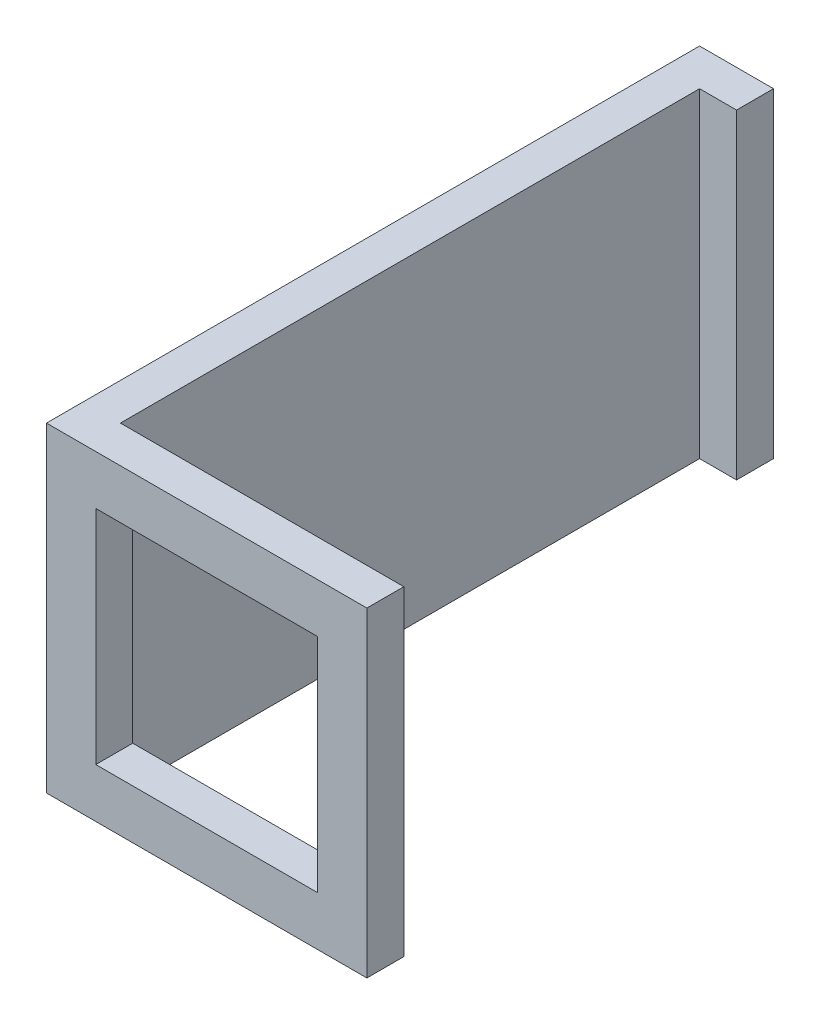
ISO-10303-21;
HEADER;
FILE_DESCRIPTION(('STEP AP214'),'2;1');
FILE_NAME('part.step','',(''),(''),'','','');
FILE_SCHEMA(('AUTOMOTIVE_DESIGN { 1 0 10303 214 1 1 1 1 }'));
ENDSEC;
DATA;
#1=APPLICATION_CONTEXT('core data for automotive mechanical design processes');
#2=APPLICATION_PROTOCOL_DEFINITION('international standard','automotive_design',2000,#1);
#3=PRODUCT_CONTEXT('',#1,'mechanical');
#4=PRODUCT('Part','Part','',(#3));
#5=PRODUCT_RELATED_PRODUCT_CATEGORY('part','',(#4));
#6=PRODUCT_DEFINITION_FORMATION('','',#4);
#7=PRODUCT_DEFINITION_CONTEXT('part definition',#1,'design');
#8=PRODUCT_DEFINITION('design','',#6,#7);
#9=PRODUCT_DEFINITION_SHAPE('','',#8);
#10=(LENGTH_UNIT() NAMED_UNIT(*) SI_UNIT(.MILLI.,.METRE.));
#11=(NAMED_UNIT(*) PLANE_ANGLE_UNIT() SI_UNIT($,.RADIAN.));
#12=(NAMED_UNIT(*) SI_UNIT($,.STERADIAN.) SOLID_ANGLE_UNIT());
#13=UNCERTAINTY_MEASURE_WITH_UNIT(LENGTH_MEASURE(1.E-05),#10,'distance_accuracy_value','');
#14=(GEOMETRIC_REPRESENTATION_CONTEXT(3) GLOBAL_UNCERTAINTY_ASSIGNED_CONTEXT((#13)) GLOBAL_UNIT_ASSIGNED_CONTEXT((#10,
#11,#12)) REPRESENTATION_CONTEXT('',''));
#15=CARTESIAN_POINT('',(0.,0.,0.));
#16=DIRECTION('',(0.,0.,1.));
#17=DIRECTION('',(1.,0.,0.));
#18=AXIS2_PLACEMENT_3D('',#15,#16,#17);
#19=CARTESIAN_POINT('',(-5.,6.5,-25.));
#20=DIRECTION('',(-1.,0.,0.));
#21=DIRECTION('',(0.,-1.,0.));
#22=AXIS2_PLACEMENT_3D('',#19,#20,#21);
#23=PLANE('',#22);
#24=DIRECTION('',(0.,-1.,0.));
#25=VECTOR('',#24,1.);
#26=CARTESIAN_POINT('',(-5.,-6.5,-23.5));
#27=LINE('',#26,#25);
#28=CARTESIAN_POINT('',(-5.,6.5,-23.5));
#29=VERTEX_POINT('',#28);
#30=CARTESIAN_POINT('',(-5.,-6.5,-23.5));
#31=VERTEX_POINT('',#30);
#32=EDGE_CURVE('E152',#29,#31,#27,.T.);
#33=ORIENTED_EDGE('',*,*,#32,.F.);
#34=DIRECTION('',(0.,0.,1.));
#35=VECTOR('',#34,1.);
#36=CARTESIAN_POINT('',(-5.,6.5,-25.));
#37=LINE('',#36,#35);
#38=CARTESIAN_POINT('',(-5.,6.5,0.));
#39=VERTEX_POINT('',#38);
#40=EDGE_CURVE('E38',#29,#39,#37,.T.);
#41=ORIENTED_EDGE('',*,*,#40,.T.);
#42=DIRECTION('',(0.,-1.,0.));
#43=VECTOR('',#42,1.);
#44=CARTESIAN_POINT('',(-5.,6.5,0.));
#45=LINE('',#44,#43);
#46=CARTESIAN_POINT('',(-5.,-6.5,0.));
#47=VERTEX_POINT('',#46);
#48=EDGE_CURVE('E162',#39,#47,#45,.T.);
#49=ORIENTED_EDGE('',*,*,#48,.T.);
#50=DIRECTION('',(0.,0.,1.));
#51=VECTOR('',#50,1.);
#52=CARTESIAN_POINT('',(-5.,-6.5,-25.));
#53=LINE('',#52,#51);
#54=EDGE_CURVE('E165',#31,#47,#53,.T.);
#55=ORIENTED_EDGE('',*,*,#54,.F.);
#56=EDGE_LOOP('',(#33,#41,#49,#55));
#57=FACE_BOUND('',#56,.T.);
#58=ADVANCED_FACE('F34',(#57),#23,.F.);
#59=CARTESIAN_POINT('',(0.,0.,0.));
#60=DIRECTION('',(0.,0.,1.));
#61=DIRECTION('',(1.,0.,0.));
#62=AXIS2_PLACEMENT_3D('',#59,#60,#61);
#63=PLANE('',#62);
#64=DIRECTION('',(0.,1.,0.));
#65=VECTOR('',#64,1.);
#66=CARTESIAN_POINT('',(4.5,-4.5,0.));
#67=LINE('',#66,#65);
#68=CARTESIAN_POINT('',(4.5,-4.5,0.));
#69=VERTEX_POINT('',#68);
#70=CARTESIAN_POINT('',(4.5,4.5,0.));
#71=VERTEX_POINT('',#70);
#72=EDGE_CURVE('E181',#69,#71,#67,.T.);
#73=ORIENTED_EDGE('',*,*,#72,.T.);
#74=DIRECTION('',(-1.,0.,0.));
#75=VECTOR('',#74,1.);
#76=CARTESIAN_POINT('',(4.5,4.5,0.));
#77=LINE('',#76,#75);
#78=CARTESIAN_POINT('',(-4.5,4.5,0.));
#79=VERTEX_POINT('',#78);
#80=EDGE_CURVE('E183',#71,#79,#77,.T.);
#81=ORIENTED_EDGE('',*,*,#80,.T.);
#82=DIRECTION('',(0.,-1.,0.));
#83=VECTOR('',#82,1.);
#84=CARTESIAN_POINT('',(-4.5,-4.5,0.));
#85=LINE('',#84,#83);
#86=CARTESIAN_POINT('',(-4.5,-4.5,0.));
#87=VERTEX_POINT('',#86);
#88=EDGE_CURVE('E188',#79,#87,#85,.T.);
#89=ORIENTED_EDGE('',*,*,#88,.T.);
#90=DIRECTION('',(1.,0.,0.));
#91=VECTOR('',#90,1.);
#92=CARTESIAN_POINT('',(4.5,-4.5,0.));
#93=LINE('',#92,#91);
#94=EDGE_CURVE('E196',#87,#69,#93,.T.);
#95=ORIENTED_EDGE('',*,*,#94,.T.);
#96=EDGE_LOOP('',(#73,#81,#89,#95));
#97=FACE_BOUND('',#96,.T.);
#98=ORIENTED_EDGE('',*,*,#48,.F.);
#99=DIRECTION('',(-1.,0.,0.));
#100=VECTOR('',#99,1.);
#101=CARTESIAN_POINT('',(6.5,6.5,0.));
#102=LINE('',#101,#100);
#103=CARTESIAN_POINT('',(6.5,6.5,0.));
#104=VERTEX_POINT('',#103);
#105=EDGE_CURVE('E211',#104,#39,#102,.T.);
#106=ORIENTED_EDGE('',*,*,#105,.F.);
#107=DIRECTION('',(0.,1.,0.));
#108=VECTOR('',#107,1.);
#109=CARTESIAN_POINT('',(6.5,-6.5,0.));
#110=LINE('',#109,#108);
#111=CARTESIAN_POINT('',(6.5,-6.5,0.));
#112=VERTEX_POINT('',#111);
#113=EDGE_CURVE('E219',#112,#104,#110,.T.);
#114=ORIENTED_EDGE('',*,*,#113,.F.);
#115=DIRECTION('',(1.,0.,0.));
#116=VECTOR('',#115,1.);
#117=CARTESIAN_POINT('',(6.5,-6.5,0.));
#118=LINE('',#117,#116);
#119=EDGE_CURVE('E173',#47,#112,#118,.T.);
#120=ORIENTED_EDGE('',*,*,#119,.F.);
#121=EDGE_LOOP('',(#98,#106,#114,#120));
#122=FACE_BOUND('',#121,.T.);
#123=ADVANCED_FACE('F243',(#97,#122),#63,.F.);
#124=CARTESIAN_POINT('',(0.,0.,1.5));
#125=DIRECTION('',(0.,0.,1.));
#126=DIRECTION('',(1.,0.,0.));
#127=AXIS2_PLACEMENT_3D('',#124,#125,#126);
#128=PLANE('',#127);
#129=DIRECTION('',(0.,-1.,0.));
#130=VECTOR('',#129,1.);
#131=CARTESIAN_POINT('',(-6.5,-6.5,1.5));
#132=LINE('',#131,#130);
#133=CARTESIAN_POINT('',(-6.5,6.5,1.5));
#134=VERTEX_POINT('',#133);
#135=CARTESIAN_POINT('',(-6.5,-6.5,1.5));
#136=VERTEX_POINT('',#135);
#137=EDGE_CURVE('E207',#134,#136,#132,.T.);
#138=ORIENTED_EDGE('',*,*,#137,.T.);
#139=DIRECTION('',(1.,0.,0.));
#140=VECTOR('',#139,1.);
#141=CARTESIAN_POINT('',(6.5,-6.5,1.5));
#142=LINE('',#141,#140);
#143=CARTESIAN_POINT('',(6.5,-6.5,1.5));
#144=VERTEX_POINT('',#143);
#145=EDGE_CURVE('E210',#136,#144,#142,.T.);
#146=ORIENTED_EDGE('',*,*,#145,.T.);
#147=DIRECTION('',(0.,1.,0.));
#148=VECTOR('',#147,1.);
#149=CARTESIAN_POINT('',(6.5,-6.5,1.5));
#150=LINE('',#149,#148);
#151=CARTESIAN_POINT('',(6.5,6.5,1.5));
#152=VERTEX_POINT('',#151);
#153=EDGE_CURVE('E213',#144,#152,#150,.T.);
#154=ORIENTED_EDGE('',*,*,#153,.T.);
#155=DIRECTION('',(-1.,0.,0.));
#156=VECTOR('',#155,1.);
#157=CARTESIAN_POINT('',(6.5,6.5,1.5));
#158=LINE('',#157,#156);
#159=EDGE_CURVE('E215',#152,#134,#158,.T.);
#160=ORIENTED_EDGE('',*,*,#159,.T.);
#161=EDGE_LOOP('',(#138,#146,#154,#160));
#162=FACE_BOUND('',#161,.T.);
#163=DIRECTION('',(-1.,0.,0.));
#164=VECTOR('',#163,1.);
#165=CARTESIAN_POINT('',(4.5,4.5,1.5));
#166=LINE('',#165,#164);
#167=CARTESIAN_POINT('',(4.5,4.5,1.5));
#168=VERTEX_POINT('',#167);
#169=CARTESIAN_POINT('',(-4.5,4.5,1.5));
#170=VERTEX_POINT('',#169);
#171=EDGE_CURVE('E392',#168,#170,#166,.T.);
#172=ORIENTED_EDGE('',*,*,#171,.F.);
#173=DIRECTION('',(0.,1.,0.));
#174=VECTOR('',#173,1.);
#175=CARTESIAN_POINT('',(4.5,-4.5,1.5));
#176=LINE('',#175,#174);
#177=CARTESIAN_POINT('',(4.5,-4.5,1.5));
#178=VERTEX_POINT('',#177);
#179=EDGE_CURVE('E168',#178,#168,#176,.T.);
#180=ORIENTED_EDGE('',*,*,#179,.F.);
#181=DIRECTION('',(1.,0.,0.));
#182=VECTOR('',#181,1.);
#183=CARTESIAN_POINT('',(4.5,-4.5,1.5));
#184=LINE('',#183,#182);
#185=CARTESIAN_POINT('',(-4.5,-4.5,1.5));
#186=VERTEX_POINT('',#185);
#187=EDGE_CURVE('E191',#186,#178,#184,.T.);
#188=ORIENTED_EDGE('',*,*,#187,.F.);
#189=DIRECTION('',(0.,-1.,0.));
#190=VECTOR('',#189,1.);
#191=CARTESIAN_POINT('',(-4.5,-4.5,1.5));
#192=LINE('',#191,#190);
#193=EDGE_CURVE('E390',#170,#186,#192,.T.);
#194=ORIENTED_EDGE('',*,*,#193,.F.);
#195=EDGE_LOOP('',(#172,#180,#188,#194));
#196=FACE_BOUND('',#195,.T.);
#197=ADVANCED_FACE('F235',(#162,#196),#128,.T.);
#198=CARTESIAN_POINT('',(-6.5,-6.5,1.5));
#199=DIRECTION('',(1.,0.,0.));
#200=DIRECTION('',(0.,0.,-1.));
#201=AXIS2_PLACEMENT_3D('',#198,#199,#200);
#202=PLANE('',#201);
#203=DIRECTION('',(0.,0.,-1.));
#204=VECTOR('',#203,1.);
#205=CARTESIAN_POINT('',(-6.5,6.5,1.5));
#206=LINE('',#205,#204);
#207=CARTESIAN_POINT('',(-6.5,6.5,-25.));
#208=VERTEX_POINT('',#207);
#209=EDGE_CURVE('E216',#134,#208,#206,.T.);
#210=ORIENTED_EDGE('',*,*,#209,.T.);
#211=DIRECTION('',(0.,1.,0.));
#212=VECTOR('',#211,1.);
#213=CARTESIAN_POINT('',(-6.5,6.5,-25.));
#214=LINE('',#213,#212);
#215=CARTESIAN_POINT('',(-6.5,-6.5,-25.));
#216=VERTEX_POINT('',#215);
#217=EDGE_CURVE('E134',#216,#208,#214,.T.);
#218=ORIENTED_EDGE('',*,*,#217,.F.);
#219=DIRECTION('',(0.,0.,-1.));
#220=VECTOR('',#219,1.);
#221=CARTESIAN_POINT('',(-6.5,-6.5,1.5));
#222=LINE('',#221,#220);
#223=EDGE_CURVE('E11',#136,#216,#222,.T.);
#224=ORIENTED_EDGE('',*,*,#223,.F.);
#225=ORIENTED_EDGE('',*,*,#137,.F.);
#226=EDGE_LOOP('',(#210,#218,#224,#225));
#227=FACE_BOUND('',#226,.T.);
#228=ADVANCED_FACE('F36',(#227),#202,.F.);
#229=CARTESIAN_POINT('',(6.5,-6.5,1.5));
#230=DIRECTION('',(0.,1.,0.));
#231=DIRECTION('',(0.,0.,1.));
#232=AXIS2_PLACEMENT_3D('',#229,#230,#231);
#233=PLANE('',#232);
#234=ORIENTED_EDGE('',*,*,#223,.T.);
#235=DIRECTION('',(-1.,0.,0.));
#236=VECTOR('',#235,1.);
#237=CARTESIAN_POINT('',(-5.,-6.5,-25.));
#238=LINE('',#237,#236);
#239=CARTESIAN_POINT('',(-3.5,-6.5,-25.));
#240=VERTEX_POINT('',#239);
#241=EDGE_CURVE('E137',#240,#216,#238,.T.);
#242=ORIENTED_EDGE('',*,*,#241,.F.);
#243=DIRECTION('',(0.,0.,-1.));
#244=VECTOR('',#243,1.);
#245=CARTESIAN_POINT('',(-3.5,-6.5,-23.5));
#246=LINE('',#245,#244);
#247=CARTESIAN_POINT('',(-3.5,-6.5,-23.5));
#248=VERTEX_POINT('',#247);
#249=EDGE_CURVE('E151',#248,#240,#246,.T.);
#250=ORIENTED_EDGE('',*,*,#249,.F.);
#251=DIRECTION('',(-1.,0.,0.));
#252=VECTOR('',#251,1.);
#253=CARTESIAN_POINT('',(-3.5,-6.5,-23.5));
#254=LINE('',#253,#252);
#255=EDGE_CURVE('E157',#248,#31,#254,.T.);
#256=ORIENTED_EDGE('',*,*,#255,.T.);
#257=ORIENTED_EDGE('',*,*,#54,.T.);
#258=ORIENTED_EDGE('',*,*,#119,.T.);
#259=DIRECTION('',(0.,0.,-1.));
#260=VECTOR('',#259,1.);
#261=CARTESIAN_POINT('',(6.5,-6.5,1.5));
#262=LINE('',#261,#260);
#263=EDGE_CURVE('E44',#144,#112,#262,.T.);
#264=ORIENTED_EDGE('',*,*,#263,.F.);
#265=ORIENTED_EDGE('',*,*,#145,.F.);
#266=EDGE_LOOP('',(#234,#242,#250,#256,#257,#258,#264,#265));
#267=FACE_BOUND('',#266,.T.);
#268=ADVANCED_FACE('F247',(#267),#233,.F.);
#269=CARTESIAN_POINT('',(6.5,-6.5,1.5));
#270=DIRECTION('',(-1.,0.,0.));
#271=DIRECTION('',(0.,0.,1.));
#272=AXIS2_PLACEMENT_3D('',#269,#270,#271);
#273=PLANE('',#272);
#274=ORIENTED_EDGE('',*,*,#113,.T.);
#275=DIRECTION('',(0.,0.,-1.));
#276=VECTOR('',#275,1.);
#277=CARTESIAN_POINT('',(6.5,6.5,1.5));
#278=LINE('',#277,#276);
#279=EDGE_CURVE('E226',#152,#104,#278,.T.);
#280=ORIENTED_EDGE('',*,*,#279,.F.);
#281=ORIENTED_EDGE('',*,*,#153,.F.);
#282=ORIENTED_EDGE('',*,*,#263,.T.);
#283=EDGE_LOOP('',(#274,#280,#281,#282));
#284=FACE_BOUND('',#283,.T.);
#285=ADVANCED_FACE('F240',(#284),#273,.F.);
#286=CARTESIAN_POINT('',(6.5,6.5,1.5));
#287=DIRECTION('',(0.,-1.,0.));
#288=DIRECTION('',(1.,0.,0.));
#289=AXIS2_PLACEMENT_3D('',#286,#287,#288);
#290=PLANE('',#289);
#291=ORIENTED_EDGE('',*,*,#105,.T.);
#292=ORIENTED_EDGE('',*,*,#40,.F.);
#293=DIRECTION('',(-1.,0.,0.));
#294=VECTOR('',#293,1.);
#295=CARTESIAN_POINT('',(-3.5,6.5,-23.5));
#296=LINE('',#295,#294);
#297=CARTESIAN_POINT('',(-3.5,6.5,-23.5));
#298=VERTEX_POINT('',#297);
#299=EDGE_CURVE('E143',#298,#29,#296,.T.);
#300=ORIENTED_EDGE('',*,*,#299,.F.);
#301=DIRECTION('',(0.,0.,1.));
#302=VECTOR('',#301,1.);
#303=CARTESIAN_POINT('',(-3.5,6.5,-23.5));
#304=LINE('',#303,#302);
#305=CARTESIAN_POINT('',(-3.5,6.5,-25.));
#306=VERTEX_POINT('',#305);
#307=EDGE_CURVE('E140',#306,#298,#304,.T.);
#308=ORIENTED_EDGE('',*,*,#307,.F.);
#309=DIRECTION('',(1.,0.,0.));
#310=VECTOR('',#309,1.);
#311=CARTESIAN_POINT('',(-5.,6.5,-25.));
#312=LINE('',#311,#310);
#313=EDGE_CURVE('E127',#208,#306,#312,.T.);
#314=ORIENTED_EDGE('',*,*,#313,.F.);
#315=ORIENTED_EDGE('',*,*,#209,.F.);
#316=ORIENTED_EDGE('',*,*,#159,.F.);
#317=ORIENTED_EDGE('',*,*,#279,.T.);
#318=EDGE_LOOP('',(#291,#292,#300,#308,#314,#315,#316,#317));
#319=FACE_BOUND('',#318,.T.);
#320=ADVANCED_FACE('F142',(#319),#290,.F.);
#321=CARTESIAN_POINT('',(4.5,-4.5,1.5));
#322=DIRECTION('',(-1.,0.,0.));
#323=DIRECTION('',(0.,0.,1.));
#324=AXIS2_PLACEMENT_3D('',#321,#322,#323);
#325=PLANE('',#324);
#326=ORIENTED_EDGE('',*,*,#72,.F.);
#327=DIRECTION('',(0.,0.,-1.));
#328=VECTOR('',#327,1.);
#329=CARTESIAN_POINT('',(4.5,-4.5,1.5));
#330=LINE('',#329,#328);
#331=EDGE_CURVE('E198',#178,#69,#330,.T.);
#332=ORIENTED_EDGE('',*,*,#331,.F.);
#333=ORIENTED_EDGE('',*,*,#179,.T.);
#334=DIRECTION('',(0.,0.,-1.));
#335=VECTOR('',#334,1.);
#336=CARTESIAN_POINT('',(4.5,4.5,1.5));
#337=LINE('',#336,#335);
#338=EDGE_CURVE('E204',#168,#71,#337,.T.);
#339=ORIENTED_EDGE('',*,*,#338,.T.);
#340=EDGE_LOOP('',(#326,#332,#333,#339));
#341=FACE_BOUND('',#340,.T.);
#342=ADVANCED_FACE('F273',(#341),#325,.T.);
#343=CARTESIAN_POINT('',(4.5,4.5,1.5));
#344=DIRECTION('',(0.,-1.,0.));
#345=DIRECTION('',(1.,0.,0.));
#346=AXIS2_PLACEMENT_3D('',#343,#344,#345);
#347=PLANE('',#346);
#348=ORIENTED_EDGE('',*,*,#80,.F.);
#349=ORIENTED_EDGE('',*,*,#338,.F.);
#350=ORIENTED_EDGE('',*,*,#171,.T.);
#351=DIRECTION('',(0.,0.,-1.));
#352=VECTOR('',#351,1.);
#353=CARTESIAN_POINT('',(-4.5,4.5,1.5));
#354=LINE('',#353,#352);
#355=EDGE_CURVE('E202',#170,#79,#354,.T.);
#356=ORIENTED_EDGE('',*,*,#355,.T.);
#357=EDGE_LOOP('',(#348,#349,#350,#356));
#358=FACE_BOUND('',#357,.T.);
#359=ADVANCED_FACE('F269',(#358),#347,.T.);
#360=CARTESIAN_POINT('',(-4.5,-4.5,1.5));
#361=DIRECTION('',(1.,0.,0.));
#362=DIRECTION('',(0.,0.,-1.));
#363=AXIS2_PLACEMENT_3D('',#360,#361,#362);
#364=PLANE('',#363);
#365=ORIENTED_EDGE('',*,*,#88,.F.);
#366=ORIENTED_EDGE('',*,*,#355,.F.);
#367=ORIENTED_EDGE('',*,*,#193,.T.);
#368=DIRECTION('',(0.,0.,-1.));
#369=VECTOR('',#368,1.);
#370=CARTESIAN_POINT('',(-4.5,-4.5,1.5));
#371=LINE('',#370,#369);
#372=EDGE_CURVE('E59',#186,#87,#371,.T.);
#373=ORIENTED_EDGE('',*,*,#372,.T.);
#374=EDGE_LOOP('',(#365,#366,#367,#373));
#375=FACE_BOUND('',#374,.T.);
#376=ADVANCED_FACE('F266',(#375),#364,.T.);
#377=CARTESIAN_POINT('',(4.5,-4.5,1.5));
#378=DIRECTION('',(0.,1.,0.));
#379=DIRECTION('',(-1.,0.,0.));
#380=AXIS2_PLACEMENT_3D('',#377,#378,#379);
#381=PLANE('',#380);
#382=ORIENTED_EDGE('',*,*,#94,.F.);
#383=ORIENTED_EDGE('',*,*,#372,.F.);
#384=ORIENTED_EDGE('',*,*,#187,.T.);
#385=ORIENTED_EDGE('',*,*,#331,.T.);
#386=EDGE_LOOP('',(#382,#383,#384,#385));
#387=FACE_BOUND('',#386,.T.);
#388=ADVANCED_FACE('F263',(#387),#381,.T.);
#389=CARTESIAN_POINT('',(0.,0.,-25.));
#390=DIRECTION('',(0.,0.,-1.));
#391=DIRECTION('',(-1.,0.,0.));
#392=AXIS2_PLACEMENT_3D('',#389,#390,#391);
#393=PLANE('',#392);
#394=ORIENTED_EDGE('',*,*,#217,.T.);
#395=ORIENTED_EDGE('',*,*,#313,.T.);
#396=DIRECTION('',(0.,1.,0.));
#397=VECTOR('',#396,1.);
#398=CARTESIAN_POINT('',(-3.5,-6.5,-25.));
#399=LINE('',#398,#397);
#400=EDGE_CURVE('E132',#240,#306,#399,.T.);
#401=ORIENTED_EDGE('',*,*,#400,.F.);
#402=ORIENTED_EDGE('',*,*,#241,.T.);
#403=EDGE_LOOP('',(#394,#395,#401,#402));
#404=FACE_BOUND('',#403,.T.);
#405=ADVANCED_FACE('F129',(#404),#393,.T.);
#406=CARTESIAN_POINT('',(-3.5,-6.5,-23.5));
#407=DIRECTION('',(0.,0.,-1.));
#408=DIRECTION('',(-1.,0.,0.));
#409=AXIS2_PLACEMENT_3D('',#406,#407,#408);
#410=PLANE('',#409);
#411=ORIENTED_EDGE('',*,*,#32,.T.);
#412=ORIENTED_EDGE('',*,*,#255,.F.);
#413=DIRECTION('',(0.,-1.,0.));
#414=VECTOR('',#413,1.);
#415=CARTESIAN_POINT('',(-3.5,-6.5,-23.5));
#416=LINE('',#415,#414);
#417=EDGE_CURVE('E146',#298,#248,#416,.T.);
#418=ORIENTED_EDGE('',*,*,#417,.F.);
#419=ORIENTED_EDGE('',*,*,#299,.T.);
#420=EDGE_LOOP('',(#411,#412,#418,#419));
#421=FACE_BOUND('',#420,.T.);
#422=ADVANCED_FACE('F246',(#421),#410,.F.);
#423=CARTESIAN_POINT('',(-3.5,0.,0.));
#424=DIRECTION('',(-1.,0.,0.));
#425=DIRECTION('',(0.,-1.,0.));
#426=AXIS2_PLACEMENT_3D('',#423,#424,#425);
#427=PLANE('',#426);
#428=ORIENTED_EDGE('',*,*,#400,.T.);
#429=ORIENTED_EDGE('',*,*,#307,.T.);
#430=ORIENTED_EDGE('',*,*,#417,.T.);
#431=ORIENTED_EDGE('',*,*,#249,.T.);
#432=EDGE_LOOP('',(#428,#429,#430,#431));
#433=FACE_BOUND('',#432,.T.);
#434=ADVANCED_FACE('F149',(#433),#427,.F.);
#435=CLOSED_SHELL('',(#58,#123,#197,#228,#268,#285,#320,#342,#359,#376,#388,#405,#422,#434));
#436=MANIFOLD_SOLID_BREP('B2',#435);
#437=ADVANCED_BREP_SHAPE_REPRESENTATION('',(#18,#436),#14);
#438=SHAPE_DEFINITION_REPRESENTATION(#9,#437);
ENDSEC;
END-ISO-10303-21;
